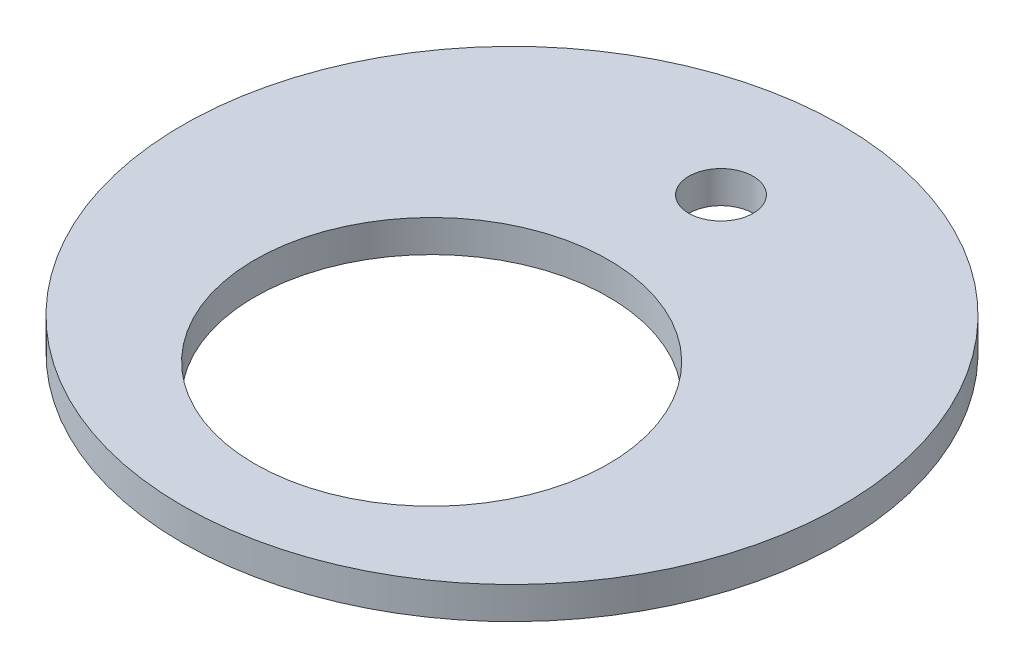
ISO-10303-21;
HEADER;
FILE_DESCRIPTION(('STEP AP214'),'2;1');
FILE_NAME('part.step','',(''),(''),'','','');
FILE_SCHEMA(('AUTOMOTIVE_DESIGN { 1 0 10303 214 1 1 1 1 }'));
ENDSEC;
DATA;
#1=APPLICATION_CONTEXT('core data for automotive mechanical design processes');
#2=APPLICATION_PROTOCOL_DEFINITION('international standard','automotive_design',2000,#1);
#3=PRODUCT_CONTEXT('',#1,'mechanical');
#4=PRODUCT('Part','Part','',(#3));
#5=PRODUCT_RELATED_PRODUCT_CATEGORY('part','',(#4));
#6=PRODUCT_DEFINITION_FORMATION('','',#4);
#7=PRODUCT_DEFINITION_CONTEXT('part definition',#1,'design');
#8=PRODUCT_DEFINITION('design','',#6,#7);
#9=PRODUCT_DEFINITION_SHAPE('','',#8);
#10=(LENGTH_UNIT() NAMED_UNIT(*) SI_UNIT(.MILLI.,.METRE.));
#11=(NAMED_UNIT(*) PLANE_ANGLE_UNIT() SI_UNIT($,.RADIAN.));
#12=(NAMED_UNIT(*) SI_UNIT($,.STERADIAN.) SOLID_ANGLE_UNIT());
#13=UNCERTAINTY_MEASURE_WITH_UNIT(LENGTH_MEASURE(1.E-05),#10,'distance_accuracy_value','');
#14=(GEOMETRIC_REPRESENTATION_CONTEXT(3) GLOBAL_UNCERTAINTY_ASSIGNED_CONTEXT((#13)) GLOBAL_UNIT_ASSIGNED_CONTEXT((#10,
#11,#12)) REPRESENTATION_CONTEXT('',''));
#15=CARTESIAN_POINT('',(0.,0.,0.));
#16=DIRECTION('',(0.,0.,1.));
#17=DIRECTION('',(1.,0.,0.));
#18=AXIS2_PLACEMENT_3D('',#15,#16,#17);
#19=CARTESIAN_POINT('',(0.,2.,5.));
#20=DIRECTION('',(0.,-1.,0.));
#21=DIRECTION('',(0.,0.,-1.));
#22=AXIS2_PLACEMENT_3D('',#19,#20,#21);
#23=CYLINDRICAL_SURFACE('',#22,11.);
#24=CARTESIAN_POINT('',(0.,2.,5.));
#25=DIRECTION('',(0.,1.,0.));
#26=DIRECTION('',(0.,0.,1.));
#27=AXIS2_PLACEMENT_3D('',#24,#25,#26);
#28=CIRCLE('',#27,11.);
#29=CARTESIAN_POINT('',(0.,2.,16.));
#30=VERTEX_POINT('',#29);
#31=EDGE_CURVE('E47',#30,#30,#28,.T.);
#32=ORIENTED_EDGE('',*,*,#31,.T.);
#33=EDGE_LOOP('',(#32));
#34=FACE_BOUND('',#33,.T.);
#35=CARTESIAN_POINT('',(0.,0.,5.));
#36=DIRECTION('',(0.,1.,0.));
#37=DIRECTION('',(0.,0.,1.));
#38=AXIS2_PLACEMENT_3D('',#35,#36,#37);
#39=CIRCLE('',#38,11.);
#40=CARTESIAN_POINT('',(0.,0.,16.));
#41=VERTEX_POINT('',#40);
#42=EDGE_CURVE('E58',#41,#41,#39,.T.);
#43=ORIENTED_EDGE('',*,*,#42,.F.);
#44=EDGE_LOOP('',(#43));
#45=FACE_BOUND('',#44,.T.);
#46=ADVANCED_FACE('F39',(#34,#45),#23,.F.);
#47=CARTESIAN_POINT('',(0.,2.,-13.));
#48=DIRECTION('',(0.,-1.,0.));
#49=DIRECTION('',(0.,0.,-1.));
#50=AXIS2_PLACEMENT_3D('',#47,#48,#49);
#51=CYLINDRICAL_SURFACE('',#50,2.);
#52=CARTESIAN_POINT('',(0.,2.,-13.));
#53=DIRECTION('',(0.,1.,0.));
#54=DIRECTION('',(0.,0.,1.));
#55=AXIS2_PLACEMENT_3D('',#52,#53,#54);
#56=CIRCLE('',#55,2.);
#57=CARTESIAN_POINT('',(0.,2.,-11.));
#58=VERTEX_POINT('',#57);
#59=EDGE_CURVE('E52',#58,#58,#56,.T.);
#60=ORIENTED_EDGE('',*,*,#59,.T.);
#61=EDGE_LOOP('',(#60));
#62=FACE_BOUND('',#61,.T.);
#63=CARTESIAN_POINT('',(0.,0.,-13.));
#64=DIRECTION('',(0.,1.,0.));
#65=DIRECTION('',(0.,0.,1.));
#66=AXIS2_PLACEMENT_3D('',#63,#64,#65);
#67=CIRCLE('',#66,2.);
#68=CARTESIAN_POINT('',(0.,0.,-11.));
#69=VERTEX_POINT('',#68);
#70=EDGE_CURVE('E56',#69,#69,#67,.T.);
#71=ORIENTED_EDGE('',*,*,#70,.F.);
#72=EDGE_LOOP('',(#71));
#73=FACE_BOUND('',#72,.T.);
#74=ADVANCED_FACE('F41',(#62,#73),#51,.F.);
#75=CARTESIAN_POINT('',(0.,2.,0.));
#76=DIRECTION('',(0.,-1.,0.));
#77=DIRECTION('',(0.,0.,-1.));
#78=AXIS2_PLACEMENT_3D('',#75,#76,#77);
#79=CYLINDRICAL_SURFACE('',#78,20.5);
#80=CARTESIAN_POINT('',(0.,2.,0.));
#81=DIRECTION('',(0.,1.,0.));
#82=DIRECTION('',(0.,0.,1.));
#83=AXIS2_PLACEMENT_3D('',#80,#81,#82);
#84=CIRCLE('',#83,20.5);
#85=CARTESIAN_POINT('',(0.,2.,20.5));
#86=VERTEX_POINT('',#85);
#87=EDGE_CURVE('E10',#86,#86,#84,.T.);
#88=ORIENTED_EDGE('',*,*,#87,.F.);
#89=EDGE_LOOP('',(#88));
#90=FACE_BOUND('',#89,.T.);
#91=CARTESIAN_POINT('',(0.,0.,0.));
#92=DIRECTION('',(0.,1.,0.));
#93=DIRECTION('',(0.,0.,1.));
#94=AXIS2_PLACEMENT_3D('',#91,#92,#93);
#95=CIRCLE('',#94,20.5);
#96=CARTESIAN_POINT('',(0.,0.,20.5));
#97=VERTEX_POINT('',#96);
#98=EDGE_CURVE('E43',#97,#97,#95,.T.);
#99=ORIENTED_EDGE('',*,*,#98,.T.);
#100=EDGE_LOOP('',(#99));
#101=FACE_BOUND('',#100,.T.);
#102=ADVANCED_FACE('F74',(#90,#101),#79,.T.);
#103=CARTESIAN_POINT('',(0.,2.,0.));
#104=DIRECTION('',(0.,1.,0.));
#105=DIRECTION('',(0.,0.,1.));
#106=AXIS2_PLACEMENT_3D('',#103,#104,#105);
#107=PLANE('',#106);
#108=ORIENTED_EDGE('',*,*,#59,.F.);
#109=EDGE_LOOP('',(#108));
#110=FACE_BOUND('',#109,.T.);
#111=ORIENTED_EDGE('',*,*,#31,.F.);
#112=EDGE_LOOP('',(#111));
#113=FACE_BOUND('',#112,.T.);
#114=ORIENTED_EDGE('',*,*,#87,.T.);
#115=EDGE_LOOP('',(#114));
#116=FACE_BOUND('',#115,.T.);
#117=ADVANCED_FACE('F70',(#110,#113,#116),#107,.T.);
#118=CARTESIAN_POINT('',(0.,0.,0.));
#119=DIRECTION('',(0.,1.,0.));
#120=DIRECTION('',(0.,0.,1.));
#121=AXIS2_PLACEMENT_3D('',#118,#119,#120);
#122=PLANE('',#121);
#123=ORIENTED_EDGE('',*,*,#70,.T.);
#124=EDGE_LOOP('',(#123));
#125=FACE_BOUND('',#124,.T.);
#126=ORIENTED_EDGE('',*,*,#42,.T.);
#127=EDGE_LOOP('',(#126));
#128=FACE_BOUND('',#127,.T.);
#129=ORIENTED_EDGE('',*,*,#98,.F.);
#130=EDGE_LOOP('',(#129));
#131=FACE_BOUND('',#130,.T.);
#132=ADVANCED_FACE('F73',(#125,#128,#131),#122,.F.);
#133=CLOSED_SHELL('',(#46,#74,#102,#117,#132));
#134=MANIFOLD_SOLID_BREP('B2',#133);
#135=ADVANCED_BREP_SHAPE_REPRESENTATION('',(#18,#134),#14);
#136=SHAPE_DEFINITION_REPRESENTATION(#9,#135);
ENDSEC;
END-ISO-10303-21;
